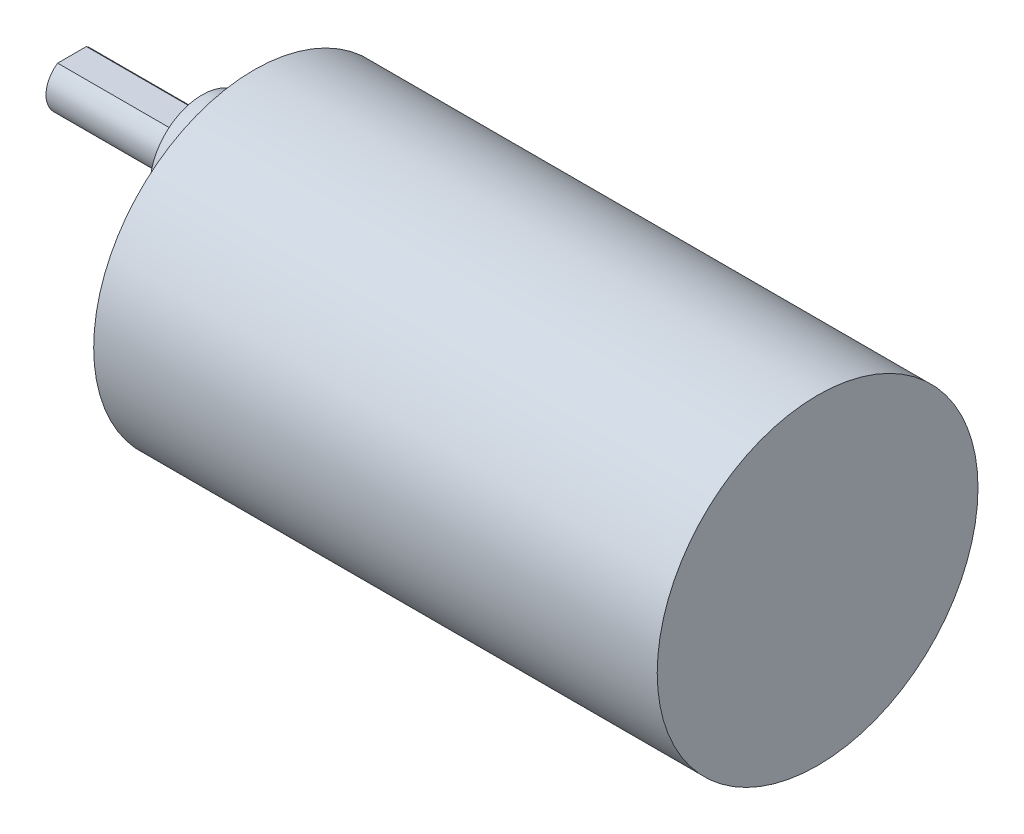
ISO-10303-21;
HEADER;
FILE_DESCRIPTION(('STEP AP214'),'2;1');
FILE_NAME('part.step','',(''),(''),'','','');
FILE_SCHEMA(('AUTOMOTIVE_DESIGN { 1 0 10303 214 1 1 1 1 }'));
ENDSEC;
DATA;
#1=APPLICATION_CONTEXT('core data for automotive mechanical design processes');
#2=APPLICATION_PROTOCOL_DEFINITION('international standard','automotive_design',2000,#1);
#3=PRODUCT_CONTEXT('',#1,'mechanical');
#4=PRODUCT('Part','Part','',(#3));
#5=PRODUCT_RELATED_PRODUCT_CATEGORY('part','',(#4));
#6=PRODUCT_DEFINITION_FORMATION('','',#4);
#7=PRODUCT_DEFINITION_CONTEXT('part definition',#1,'design');
#8=PRODUCT_DEFINITION('design','',#6,#7);
#9=PRODUCT_DEFINITION_SHAPE('','',#8);
#10=(LENGTH_UNIT() NAMED_UNIT(*) SI_UNIT(.MILLI.,.METRE.));
#11=(NAMED_UNIT(*) PLANE_ANGLE_UNIT() SI_UNIT($,.RADIAN.));
#12=(NAMED_UNIT(*) SI_UNIT($,.STERADIAN.) SOLID_ANGLE_UNIT());
#13=UNCERTAINTY_MEASURE_WITH_UNIT(LENGTH_MEASURE(1.E-05),#10,'distance_accuracy_value','');
#14=(GEOMETRIC_REPRESENTATION_CONTEXT(3) GLOBAL_UNCERTAINTY_ASSIGNED_CONTEXT((#13)) GLOBAL_UNIT_ASSIGNED_CONTEXT((#10,
#11,#12)) REPRESENTATION_CONTEXT('',''));
#15=CARTESIAN_POINT('',(0.,0.,0.));
#16=DIRECTION('',(0.,0.,1.));
#17=DIRECTION('',(1.,0.,0.));
#18=AXIS2_PLACEMENT_3D('',#15,#16,#17);
#19=CARTESIAN_POINT('',(65.,0.,0.));
#20=DIRECTION('',(-1.,0.,0.));
#21=DIRECTION('',(0.,0.,1.));
#22=AXIS2_PLACEMENT_3D('',#19,#20,#21);
#23=CYLINDRICAL_SURFACE('',#22,18.5);
#24=CARTESIAN_POINT('',(65.,0.,0.));
#25=DIRECTION('',(1.,0.,0.));
#26=DIRECTION('',(0.,0.,-1.));
#27=AXIS2_PLACEMENT_3D('',#24,#25,#26);
#28=CIRCLE('',#27,18.5);
#29=CARTESIAN_POINT('',(65.,0.,-18.5));
#30=VERTEX_POINT('',#29);
#31=EDGE_CURVE('E54',#30,#30,#28,.T.);
#32=ORIENTED_EDGE('',*,*,#31,.F.);
#33=EDGE_LOOP('',(#32));
#34=FACE_BOUND('',#33,.T.);
#35=CARTESIAN_POINT('',(0.,0.,0.));
#36=DIRECTION('',(1.,0.,0.));
#37=DIRECTION('',(0.,0.,-1.));
#38=AXIS2_PLACEMENT_3D('',#35,#36,#37);
#39=CIRCLE('',#38,18.5);
#40=CARTESIAN_POINT('',(0.,0.,-18.5));
#41=VERTEX_POINT('',#40);
#42=EDGE_CURVE('E105',#41,#41,#39,.T.);
#43=ORIENTED_EDGE('',*,*,#42,.T.);
#44=EDGE_LOOP('',(#43));
#45=FACE_BOUND('',#44,.T.);
#46=ADVANCED_FACE('F46',(#34,#45),#23,.T.);
#47=CARTESIAN_POINT('',(65.,0.,0.));
#48=DIRECTION('',(1.,0.,0.));
#49=DIRECTION('',(0.,0.,-1.));
#50=AXIS2_PLACEMENT_3D('',#47,#48,#49);
#51=PLANE('',#50);
#52=ORIENTED_EDGE('',*,*,#31,.T.);
#53=EDGE_LOOP('',(#52));
#54=FACE_BOUND('',#53,.T.);
#55=ADVANCED_FACE('F116',(#54),#51,.T.);
#56=CARTESIAN_POINT('',(0.,0.,0.));
#57=DIRECTION('',(1.,0.,0.));
#58=DIRECTION('',(0.,0.,-1.));
#59=AXIS2_PLACEMENT_3D('',#56,#57,#58);
#60=PLANE('',#59);
#61=CARTESIAN_POINT('',(0.,7.,0.));
#62=DIRECTION('',(1.,0.,0.));
#63=DIRECTION('',(0.,0.,-1.));
#64=AXIS2_PLACEMENT_3D('',#61,#62,#63);
#65=CIRCLE('',#64,6.);
#66=CARTESIAN_POINT('',(0.,7.,-6.));
#67=VERTEX_POINT('',#66);
#68=EDGE_CURVE('E11',#67,#67,#65,.F.);
#69=ORIENTED_EDGE('',*,*,#68,.F.);
#70=EDGE_LOOP('',(#69));
#71=FACE_BOUND('',#70,.T.);
#72=ORIENTED_EDGE('',*,*,#42,.F.);
#73=EDGE_LOOP('',(#72));
#74=FACE_BOUND('',#73,.T.);
#75=ADVANCED_FACE('F113',(#71,#74),#60,.F.);
#76=CARTESIAN_POINT('',(-6.,7.,0.));
#77=DIRECTION('',(1.,0.,0.));
#78=DIRECTION('',(0.,0.,-1.));
#79=AXIS2_PLACEMENT_3D('',#76,#77,#78);
#80=CYLINDRICAL_SURFACE('',#79,6.);
#81=CARTESIAN_POINT('',(-6.,7.,0.));
#82=DIRECTION('',(-1.,0.,0.));
#83=DIRECTION('',(0.,0.,1.));
#84=AXIS2_PLACEMENT_3D('',#81,#82,#83);
#85=CIRCLE('',#84,6.);
#86=CARTESIAN_POINT('',(-6.,7.,6.));
#87=VERTEX_POINT('',#86);
#88=EDGE_CURVE('E97',#87,#87,#85,.T.);
#89=ORIENTED_EDGE('',*,*,#88,.F.);
#90=EDGE_LOOP('',(#89));
#91=FACE_BOUND('',#90,.T.);
#92=ORIENTED_EDGE('',*,*,#68,.T.);
#93=EDGE_LOOP('',(#92));
#94=FACE_BOUND('',#93,.T.);
#95=ADVANCED_FACE('F115',(#91,#94),#80,.T.);
#96=CARTESIAN_POINT('',(-6.,7.,0.));
#97=DIRECTION('',(-1.,0.,0.));
#98=DIRECTION('',(0.,0.,1.));
#99=AXIS2_PLACEMENT_3D('',#96,#97,#98);
#100=PLANE('',#99);
#101=CARTESIAN_POINT('',(-6.,7.,0.));
#102=DIRECTION('',(-1.,0.,0.));
#103=DIRECTION('',(0.,0.,1.));
#104=AXIS2_PLACEMENT_3D('',#101,#102,#103);
#105=CIRCLE('',#104,3.);
#106=CARTESIAN_POINT('',(-6.,9.5,-1.6583123951777));
#107=VERTEX_POINT('',#106);
#108=CARTESIAN_POINT('',(-6.,9.5,1.6583123951777));
#109=VERTEX_POINT('',#108);
#110=EDGE_CURVE('E77',#107,#109,#105,.T.);
#111=ORIENTED_EDGE('',*,*,#110,.F.);
#112=DIRECTION('',(0.,0.,-1.));
#113=VECTOR('',#112,1.);
#114=CARTESIAN_POINT('',(-6.,9.5,-1.6583123951777));
#115=LINE('',#114,#113);
#116=EDGE_CURVE('E63',#109,#107,#115,.T.);
#117=ORIENTED_EDGE('',*,*,#116,.F.);
#118=EDGE_LOOP('',(#111,#117));
#119=FACE_BOUND('',#118,.T.);
#120=ORIENTED_EDGE('',*,*,#88,.T.);
#121=EDGE_LOOP('',(#120));
#122=FACE_BOUND('',#121,.T.);
#123=ADVANCED_FACE('F78',(#119,#122),#100,.T.);
#124=CARTESIAN_POINT('',(-21.,7.,0.));
#125=DIRECTION('',(1.,0.,0.));
#126=DIRECTION('',(0.,0.,-1.));
#127=AXIS2_PLACEMENT_3D('',#124,#125,#126);
#128=CYLINDRICAL_SURFACE('',#127,3.);
#129=ORIENTED_EDGE('',*,*,#110,.T.);
#130=DIRECTION('',(1.,0.,0.));
#131=VECTOR('',#130,1.);
#132=CARTESIAN_POINT('',(-21.,9.5,1.6583123951777));
#133=LINE('',#132,#131);
#134=CARTESIAN_POINT('',(-21.,9.5,1.6583123951777));
#135=VERTEX_POINT('',#134);
#136=EDGE_CURVE('E89',#135,#109,#133,.T.);
#137=ORIENTED_EDGE('',*,*,#136,.F.);
#138=CARTESIAN_POINT('',(-21.,7.,0.));
#139=DIRECTION('',(-1.,0.,0.));
#140=DIRECTION('',(0.,0.,1.));
#141=AXIS2_PLACEMENT_3D('',#138,#139,#140);
#142=CIRCLE('',#141,3.);
#143=CARTESIAN_POINT('',(-21.,9.5,-1.6583123951777));
#144=VERTEX_POINT('',#143);
#145=EDGE_CURVE('E91',#144,#135,#142,.T.);
#146=ORIENTED_EDGE('',*,*,#145,.F.);
#147=DIRECTION('',(1.,0.,0.));
#148=VECTOR('',#147,1.);
#149=CARTESIAN_POINT('',(-21.,9.5,-1.6583123951777));
#150=LINE('',#149,#148);
#151=EDGE_CURVE('E87',#144,#107,#150,.T.);
#152=ORIENTED_EDGE('',*,*,#151,.T.);
#153=EDGE_LOOP('',(#129,#137,#146,#152));
#154=FACE_BOUND('',#153,.T.);
#155=ADVANCED_FACE('F93',(#154),#128,.T.);
#156=CARTESIAN_POINT('',(-21.,9.5,-1.6583123951777));
#157=DIRECTION('',(0.,-1.,0.));
#158=DIRECTION('',(0.,0.,-1.));
#159=AXIS2_PLACEMENT_3D('',#156,#157,#158);
#160=PLANE('',#159);
#161=ORIENTED_EDGE('',*,*,#116,.T.);
#162=ORIENTED_EDGE('',*,*,#151,.F.);
#163=DIRECTION('',(0.,0.,-1.));
#164=VECTOR('',#163,1.);
#165=CARTESIAN_POINT('',(-21.,9.5,-1.6583123951777));
#166=LINE('',#165,#164);
#167=EDGE_CURVE('E72',#135,#144,#166,.T.);
#168=ORIENTED_EDGE('',*,*,#167,.F.);
#169=ORIENTED_EDGE('',*,*,#136,.T.);
#170=EDGE_LOOP('',(#161,#162,#168,#169));
#171=FACE_BOUND('',#170,.T.);
#172=ADVANCED_FACE('F86',(#171),#160,.F.);
#173=CARTESIAN_POINT('',(-21.,7.,0.));
#174=DIRECTION('',(-1.,0.,0.));
#175=DIRECTION('',(0.,0.,1.));
#176=AXIS2_PLACEMENT_3D('',#173,#174,#175);
#177=PLANE('',#176);
#178=ORIENTED_EDGE('',*,*,#145,.T.);
#179=ORIENTED_EDGE('',*,*,#167,.T.);
#180=EDGE_LOOP('',(#178,#179));
#181=FACE_BOUND('',#180,.T.);
#182=ADVANCED_FACE('F156',(#181),#177,.T.);
#183=CLOSED_SHELL('',(#46,#55,#75,#95,#123,#155,#172,#182));
#184=MANIFOLD_SOLID_BREP('B2',#183);
#185=ADVANCED_BREP_SHAPE_REPRESENTATION('',(#18,#184),#14);
#186=SHAPE_DEFINITION_REPRESENTATION(#9,#185);
ENDSEC;
END-ISO-10303-21;
